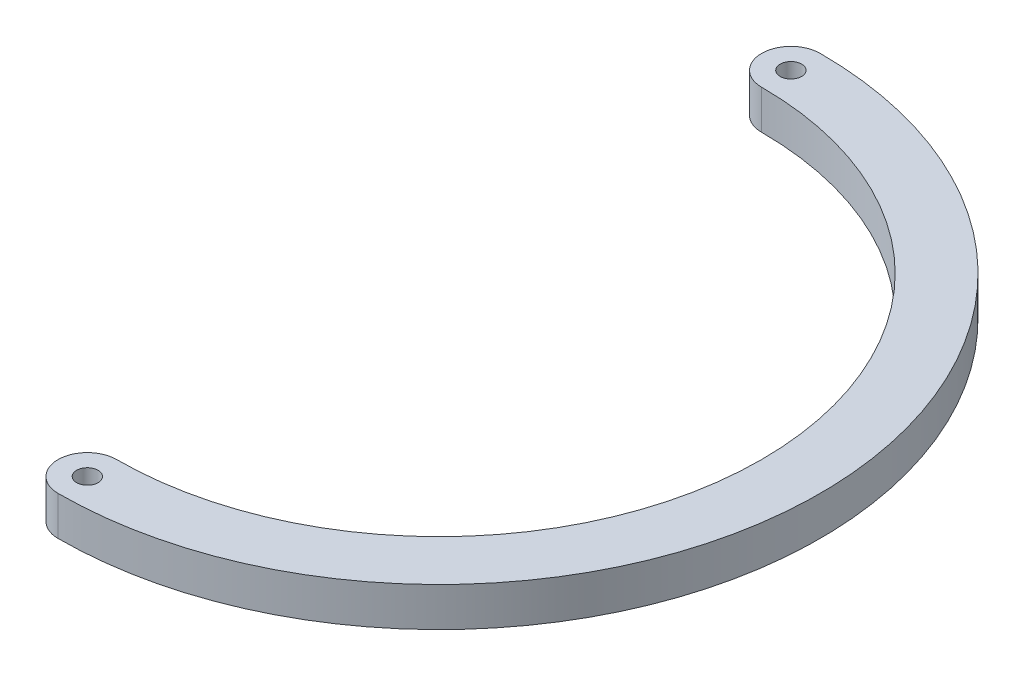
ISO-10303-21;
HEADER;
FILE_DESCRIPTION(('STEP AP214'),'2;1');
FILE_NAME('part.step','',(''),(''),'','','');
FILE_SCHEMA(('AUTOMOTIVE_DESIGN { 1 0 10303 214 1 1 1 1 }'));
ENDSEC;
DATA;
#1=APPLICATION_CONTEXT('core data for automotive mechanical design processes');
#2=APPLICATION_PROTOCOL_DEFINITION('international standard','automotive_design',2000,#1);
#3=PRODUCT_CONTEXT('',#1,'mechanical');
#4=PRODUCT('Part','Part','',(#3));
#5=PRODUCT_RELATED_PRODUCT_CATEGORY('part','',(#4));
#6=PRODUCT_DEFINITION_FORMATION('','',#4);
#7=PRODUCT_DEFINITION_CONTEXT('part definition',#1,'design');
#8=PRODUCT_DEFINITION('design','',#6,#7);
#9=PRODUCT_DEFINITION_SHAPE('','',#8);
#10=(LENGTH_UNIT() NAMED_UNIT(*) SI_UNIT(.MILLI.,.METRE.));
#11=(NAMED_UNIT(*) PLANE_ANGLE_UNIT() SI_UNIT($,.RADIAN.));
#12=(NAMED_UNIT(*) SI_UNIT($,.STERADIAN.) SOLID_ANGLE_UNIT());
#13=UNCERTAINTY_MEASURE_WITH_UNIT(LENGTH_MEASURE(1.E-05),#10,'distance_accuracy_value','');
#14=(GEOMETRIC_REPRESENTATION_CONTEXT(3) GLOBAL_UNCERTAINTY_ASSIGNED_CONTEXT((#13)) GLOBAL_UNIT_ASSIGNED_CONTEXT((#10,
#11,#12)) REPRESENTATION_CONTEXT('',''));
#15=CARTESIAN_POINT('',(0.,0.,0.));
#16=DIRECTION('',(0.,0.,1.));
#17=DIRECTION('',(1.,0.,0.));
#18=AXIS2_PLACEMENT_3D('',#15,#16,#17);
#19=CARTESIAN_POINT('',(0.,5.,-90.05));
#20=DIRECTION('',(0.,-1.,0.));
#21=DIRECTION('',(0.,0.,-1.));
#22=AXIS2_PLACEMENT_3D('',#19,#20,#21);
#23=CYLINDRICAL_SURFACE('',#22,7.5);
#24=CARTESIAN_POINT('',(0.,-5.,-90.05));
#25=DIRECTION('',(0.,1.,0.));
#26=DIRECTION('',(0.,0.,1.));
#27=AXIS2_PLACEMENT_3D('',#24,#25,#26);
#28=CIRCLE('',#27,7.5);
#29=CARTESIAN_POINT('',(0.,-5.,-97.55));
#30=VERTEX_POINT('',#29);
#31=CARTESIAN_POINT('',(0.,-5.,-82.55));
#32=VERTEX_POINT('',#31);
#33=EDGE_CURVE('E97',#30,#32,#28,.T.);
#34=ORIENTED_EDGE('',*,*,#33,.T.);
#35=DIRECTION('',(0.,-1.,0.));
#36=VECTOR('',#35,1.);
#37=CARTESIAN_POINT('',(0.,5.,-82.55));
#38=LINE('',#37,#36);
#39=CARTESIAN_POINT('',(0.,5.,-82.55));
#40=VERTEX_POINT('',#39);
#41=EDGE_CURVE('E11',#40,#32,#38,.T.);
#42=ORIENTED_EDGE('',*,*,#41,.F.);
#43=CARTESIAN_POINT('',(0.,5.,-90.05));
#44=DIRECTION('',(0.,1.,0.));
#45=DIRECTION('',(0.,0.,1.));
#46=AXIS2_PLACEMENT_3D('',#43,#44,#45);
#47=CIRCLE('',#46,7.5);
#48=CARTESIAN_POINT('',(0.,5.,-97.55));
#49=VERTEX_POINT('',#48);
#50=EDGE_CURVE('E85',#49,#40,#47,.T.);
#51=ORIENTED_EDGE('',*,*,#50,.F.);
#52=DIRECTION('',(0.,-1.,0.));
#53=VECTOR('',#52,1.);
#54=CARTESIAN_POINT('',(0.,5.,-97.55));
#55=LINE('',#54,#53);
#56=EDGE_CURVE('E93',#49,#30,#55,.T.);
#57=ORIENTED_EDGE('',*,*,#56,.T.);
#58=EDGE_LOOP('',(#34,#42,#51,#57));
#59=FACE_BOUND('',#58,.T.);
#60=ADVANCED_FACE('F34',(#59),#23,.T.);
#61=CARTESIAN_POINT('',(0.,5.,0.));
#62=DIRECTION('',(0.,-1.,0.));
#63=DIRECTION('',(0.,0.,-1.));
#64=AXIS2_PLACEMENT_3D('',#61,#62,#63);
#65=CYLINDRICAL_SURFACE('',#64,82.55);
#66=CARTESIAN_POINT('',(0.,-5.,0.));
#67=DIRECTION('',(0.,-1.,0.));
#68=DIRECTION('',(0.,0.,1.));
#69=AXIS2_PLACEMENT_3D('',#66,#67,#68);
#70=CIRCLE('',#69,82.55);
#71=CARTESIAN_POINT('',(0.,-5.,82.55));
#72=VERTEX_POINT('',#71);
#73=EDGE_CURVE('E89',#32,#72,#70,.T.);
#74=ORIENTED_EDGE('',*,*,#73,.T.);
#75=DIRECTION('',(0.,-1.,0.));
#76=VECTOR('',#75,1.);
#77=CARTESIAN_POINT('',(0.,5.,82.55));
#78=LINE('',#77,#76);
#79=CARTESIAN_POINT('',(0.,5.,82.55));
#80=VERTEX_POINT('',#79);
#81=EDGE_CURVE('E42',#80,#72,#78,.T.);
#82=ORIENTED_EDGE('',*,*,#81,.F.);
#83=CARTESIAN_POINT('',(0.,5.,0.));
#84=DIRECTION('',(0.,-1.,0.));
#85=DIRECTION('',(0.,0.,1.));
#86=AXIS2_PLACEMENT_3D('',#83,#84,#85);
#87=CIRCLE('',#86,82.55);
#88=EDGE_CURVE('E80',#40,#80,#87,.T.);
#89=ORIENTED_EDGE('',*,*,#88,.F.);
#90=ORIENTED_EDGE('',*,*,#41,.T.);
#91=EDGE_LOOP('',(#74,#82,#89,#90));
#92=FACE_BOUND('',#91,.T.);
#93=ADVANCED_FACE('F88',(#92),#65,.F.);
#94=CARTESIAN_POINT('',(0.,5.,90.05));
#95=DIRECTION('',(0.,-1.,0.));
#96=DIRECTION('',(0.,0.,-1.));
#97=AXIS2_PLACEMENT_3D('',#94,#95,#96);
#98=CYLINDRICAL_SURFACE('',#97,7.5);
#99=CARTESIAN_POINT('',(0.,-5.,90.05));
#100=DIRECTION('',(0.,1.,0.));
#101=DIRECTION('',(0.,0.,1.));
#102=AXIS2_PLACEMENT_3D('',#99,#100,#101);
#103=CIRCLE('',#102,7.5);
#104=CARTESIAN_POINT('',(0.,-5.,97.55));
#105=VERTEX_POINT('',#104);
#106=EDGE_CURVE('E67',#72,#105,#103,.T.);
#107=ORIENTED_EDGE('',*,*,#106,.T.);
#108=DIRECTION('',(0.,-1.,0.));
#109=VECTOR('',#108,1.);
#110=CARTESIAN_POINT('',(0.,5.,97.55));
#111=LINE('',#110,#109);
#112=CARTESIAN_POINT('',(0.,5.,97.55));
#113=VERTEX_POINT('',#112);
#114=EDGE_CURVE('E90',#113,#105,#111,.T.);
#115=ORIENTED_EDGE('',*,*,#114,.F.);
#116=CARTESIAN_POINT('',(0.,5.,90.05));
#117=DIRECTION('',(0.,1.,0.));
#118=DIRECTION('',(0.,0.,1.));
#119=AXIS2_PLACEMENT_3D('',#116,#117,#118);
#120=CIRCLE('',#119,7.5);
#121=EDGE_CURVE('E83',#80,#113,#120,.T.);
#122=ORIENTED_EDGE('',*,*,#121,.F.);
#123=ORIENTED_EDGE('',*,*,#81,.T.);
#124=EDGE_LOOP('',(#107,#115,#122,#123));
#125=FACE_BOUND('',#124,.T.);
#126=ADVANCED_FACE('F91',(#125),#98,.T.);
#127=CARTESIAN_POINT('',(0.,5.,0.));
#128=DIRECTION('',(0.,-1.,0.));
#129=DIRECTION('',(0.,0.,-1.));
#130=AXIS2_PLACEMENT_3D('',#127,#128,#129);
#131=CYLINDRICAL_SURFACE('',#130,97.55);
#132=CARTESIAN_POINT('',(0.,-5.,0.));
#133=DIRECTION('',(0.,1.,0.));
#134=DIRECTION('',(0.,0.,1.));
#135=AXIS2_PLACEMENT_3D('',#132,#133,#134);
#136=CIRCLE('',#135,97.55);
#137=EDGE_CURVE('E73',#105,#30,#136,.T.);
#138=ORIENTED_EDGE('',*,*,#137,.T.);
#139=ORIENTED_EDGE('',*,*,#56,.F.);
#140=CARTESIAN_POINT('',(0.,5.,0.));
#141=DIRECTION('',(0.,1.,0.));
#142=DIRECTION('',(0.,0.,1.));
#143=AXIS2_PLACEMENT_3D('',#140,#141,#142);
#144=CIRCLE('',#143,97.55);
#145=EDGE_CURVE('E50',#113,#49,#144,.T.);
#146=ORIENTED_EDGE('',*,*,#145,.F.);
#147=ORIENTED_EDGE('',*,*,#114,.T.);
#148=EDGE_LOOP('',(#138,#139,#146,#147));
#149=FACE_BOUND('',#148,.T.);
#150=ADVANCED_FACE('F105',(#149),#131,.T.);
#151=CARTESIAN_POINT('',(0.,5.,-45.025));
#152=DIRECTION('',(0.,1.,0.));
#153=DIRECTION('',(0.,0.,1.));
#154=AXIS2_PLACEMENT_3D('',#151,#152,#153);
#155=PLANE('',#154);
#156=CARTESIAN_POINT('',(0.,5.,-90.05));
#157=DIRECTION('',(0.,1.,0.));
#158=DIRECTION('',(0.,0.,1.));
#159=AXIS2_PLACEMENT_3D('',#156,#157,#158);
#160=CIRCLE('',#159,2.74999999999999);
#161=CARTESIAN_POINT('',(0.,5.,-87.3));
#162=VERTEX_POINT('',#161);
#163=EDGE_CURVE('E119',#162,#162,#160,.T.);
#164=ORIENTED_EDGE('',*,*,#163,.F.);
#165=EDGE_LOOP('',(#164));
#166=FACE_BOUND('',#165,.T.);
#167=CARTESIAN_POINT('',(0.,5.,90.05));
#168=DIRECTION('',(0.,1.,0.));
#169=DIRECTION('',(0.,0.,1.));
#170=AXIS2_PLACEMENT_3D('',#167,#168,#169);
#171=CIRCLE('',#170,2.74999999999999);
#172=CARTESIAN_POINT('',(0.,5.,92.8));
#173=VERTEX_POINT('',#172);
#174=EDGE_CURVE('E113',#173,#173,#171,.T.);
#175=ORIENTED_EDGE('',*,*,#174,.F.);
#176=EDGE_LOOP('',(#175));
#177=FACE_BOUND('',#176,.T.);
#178=ORIENTED_EDGE('',*,*,#50,.T.);
#179=ORIENTED_EDGE('',*,*,#88,.T.);
#180=ORIENTED_EDGE('',*,*,#121,.T.);
#181=ORIENTED_EDGE('',*,*,#145,.T.);
#182=EDGE_LOOP('',(#178,#179,#180,#181));
#183=FACE_BOUND('',#182,.T.);
#184=ADVANCED_FACE('F81',(#166,#177,#183),#155,.T.);
#185=CARTESIAN_POINT('',(0.,-5.,-45.025));
#186=DIRECTION('',(0.,1.,0.));
#187=DIRECTION('',(0.,0.,1.));
#188=AXIS2_PLACEMENT_3D('',#185,#186,#187);
#189=PLANE('',#188);
#190=CARTESIAN_POINT('',(0.,-5.,-90.05));
#191=DIRECTION('',(0.,1.,0.));
#192=DIRECTION('',(0.,0.,1.));
#193=AXIS2_PLACEMENT_3D('',#190,#191,#192);
#194=CIRCLE('',#193,2.75);
#195=CARTESIAN_POINT('',(0.,-5.,-87.3));
#196=VERTEX_POINT('',#195);
#197=EDGE_CURVE('E116',#196,#196,#194,.T.);
#198=ORIENTED_EDGE('',*,*,#197,.T.);
#199=EDGE_LOOP('',(#198));
#200=FACE_BOUND('',#199,.T.);
#201=CARTESIAN_POINT('',(0.,-5.,90.05));
#202=DIRECTION('',(0.,1.,0.));
#203=DIRECTION('',(0.,0.,1.));
#204=AXIS2_PLACEMENT_3D('',#201,#202,#203);
#205=CIRCLE('',#204,2.75);
#206=CARTESIAN_POINT('',(0.,-5.,92.8));
#207=VERTEX_POINT('',#206);
#208=EDGE_CURVE('E100',#207,#207,#205,.T.);
#209=ORIENTED_EDGE('',*,*,#208,.T.);
#210=EDGE_LOOP('',(#209));
#211=FACE_BOUND('',#210,.T.);
#212=ORIENTED_EDGE('',*,*,#33,.F.);
#213=ORIENTED_EDGE('',*,*,#137,.F.);
#214=ORIENTED_EDGE('',*,*,#106,.F.);
#215=ORIENTED_EDGE('',*,*,#73,.F.);
#216=EDGE_LOOP('',(#212,#213,#214,#215));
#217=FACE_BOUND('',#216,.T.);
#218=ADVANCED_FACE('F108',(#200,#211,#217),#189,.F.);
#219=CARTESIAN_POINT('',(0.,5.,90.05));
#220=DIRECTION('',(0.,1.,0.));
#221=DIRECTION('',(0.,0.,1.));
#222=AXIS2_PLACEMENT_3D('',#219,#220,#221);
#223=CYLINDRICAL_SURFACE('',#222,2.74999999999999);
#224=ORIENTED_EDGE('',*,*,#208,.F.);
#225=EDGE_LOOP('',(#224));
#226=FACE_BOUND('',#225,.T.);
#227=ORIENTED_EDGE('',*,*,#174,.T.);
#228=EDGE_LOOP('',(#227));
#229=FACE_BOUND('',#228,.T.);
#230=ADVANCED_FACE('F130',(#226,#229),#223,.F.);
#231=CARTESIAN_POINT('',(0.,5.,-90.05));
#232=DIRECTION('',(0.,1.,0.));
#233=DIRECTION('',(0.,0.,1.));
#234=AXIS2_PLACEMENT_3D('',#231,#232,#233);
#235=CYLINDRICAL_SURFACE('',#234,2.74999999999999);
#236=ORIENTED_EDGE('',*,*,#197,.F.);
#237=EDGE_LOOP('',(#236));
#238=FACE_BOUND('',#237,.T.);
#239=ORIENTED_EDGE('',*,*,#163,.T.);
#240=EDGE_LOOP('',(#239));
#241=FACE_BOUND('',#240,.T.);
#242=ADVANCED_FACE('F123',(#238,#241),#235,.F.);
#243=CLOSED_SHELL('',(#60,#93,#126,#150,#184,#218,#230,#242));
#244=MANIFOLD_SOLID_BREP('B2',#243);
#245=ADVANCED_BREP_SHAPE_REPRESENTATION('',(#18,#244),#14);
#246=SHAPE_DEFINITION_REPRESENTATION(#9,#245);
ENDSEC;
END-ISO-10303-21;
